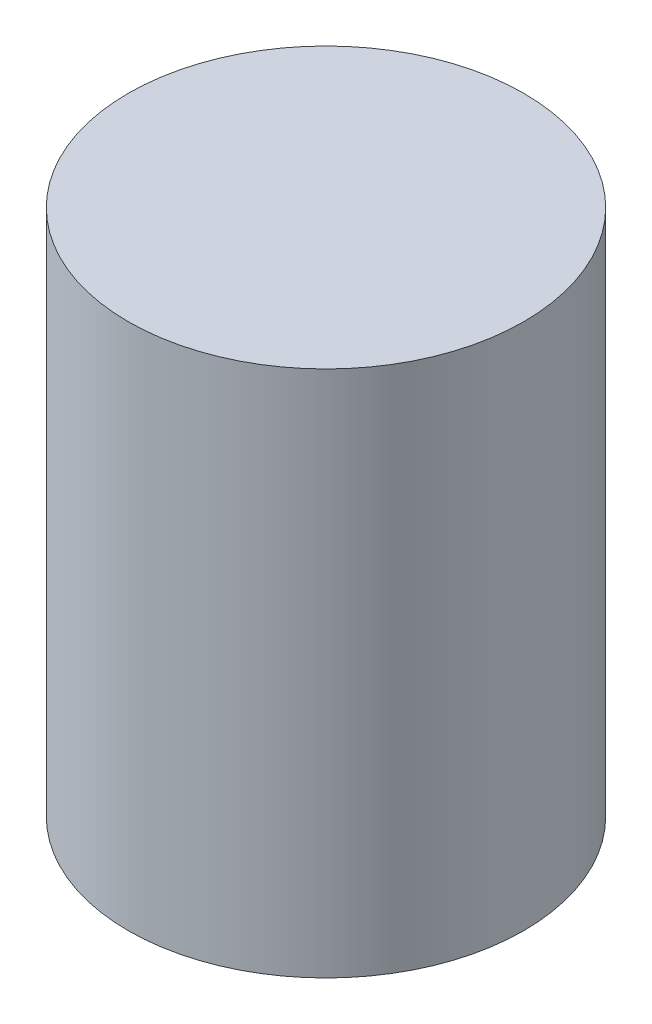
ISO-10303-21;
HEADER;
FILE_DESCRIPTION(('STEP AP214'),'2;1');
FILE_NAME('part.step','',(''),(''),'','','');
FILE_SCHEMA(('AUTOMOTIVE_DESIGN { 1 0 10303 214 1 1 1 1 }'));
ENDSEC;
DATA;
#1=APPLICATION_CONTEXT('core data for automotive mechanical design processes');
#2=APPLICATION_PROTOCOL_DEFINITION('international standard','automotive_design',2000,#1);
#3=PRODUCT_CONTEXT('',#1,'mechanical');
#4=PRODUCT('Part','Part','',(#3));
#5=PRODUCT_RELATED_PRODUCT_CATEGORY('part','',(#4));
#6=PRODUCT_DEFINITION_FORMATION('','',#4);
#7=PRODUCT_DEFINITION_CONTEXT('part definition',#1,'design');
#8=PRODUCT_DEFINITION('design','',#6,#7);
#9=PRODUCT_DEFINITION_SHAPE('','',#8);
#10=(LENGTH_UNIT() NAMED_UNIT(*) SI_UNIT(.MILLI.,.METRE.));
#11=(NAMED_UNIT(*) PLANE_ANGLE_UNIT() SI_UNIT($,.RADIAN.));
#12=(NAMED_UNIT(*) SI_UNIT($,.STERADIAN.) SOLID_ANGLE_UNIT());
#13=UNCERTAINTY_MEASURE_WITH_UNIT(LENGTH_MEASURE(1.E-05),#10,'distance_accuracy_value','');
#14=(GEOMETRIC_REPRESENTATION_CONTEXT(3) GLOBAL_UNCERTAINTY_ASSIGNED_CONTEXT((#13)) GLOBAL_UNIT_ASSIGNED_CONTEXT((#10,
#11,#12)) REPRESENTATION_CONTEXT('',''));
#15=CARTESIAN_POINT('',(0.,0.,0.));
#16=DIRECTION('',(0.,0.,1.));
#17=DIRECTION('',(1.,0.,0.));
#18=AXIS2_PLACEMENT_3D('',#15,#16,#17);
#19=CARTESIAN_POINT('',(0.,6.35,0.));
#20=DIRECTION('',(0.,-1.,0.));
#21=DIRECTION('',(0.,0.,-1.));
#22=AXIS2_PLACEMENT_3D('',#19,#20,#21);
#23=CYLINDRICAL_SURFACE('',#22,2.38125);
#24=CARTESIAN_POINT('',(0.,6.35,0.));
#25=DIRECTION('',(0.,1.,0.));
#26=DIRECTION('',(0.,0.,1.));
#27=AXIS2_PLACEMENT_3D('',#24,#25,#26);
#28=CIRCLE('',#27,2.38125);
#29=CARTESIAN_POINT('',(0.,6.35,2.38125));
#30=VERTEX_POINT('',#29);
#31=EDGE_CURVE('E10',#30,#30,#28,.T.);
#32=ORIENTED_EDGE('',*,*,#31,.F.);
#33=EDGE_LOOP('',(#32));
#34=FACE_BOUND('',#33,.T.);
#35=CARTESIAN_POINT('',(0.,0.,0.));
#36=DIRECTION('',(0.,1.,0.));
#37=DIRECTION('',(0.,0.,1.));
#38=AXIS2_PLACEMENT_3D('',#35,#36,#37);
#39=CIRCLE('',#38,2.38125);
#40=CARTESIAN_POINT('',(0.,0.,2.38125));
#41=VERTEX_POINT('',#40);
#42=EDGE_CURVE('E44',#41,#41,#39,.T.);
#43=ORIENTED_EDGE('',*,*,#42,.T.);
#44=EDGE_LOOP('',(#43));
#45=FACE_BOUND('',#44,.T.);
#46=ADVANCED_FACE('F41',(#34,#45),#23,.T.);
#47=CARTESIAN_POINT('',(0.,6.35,0.));
#48=DIRECTION('',(0.,1.,0.));
#49=DIRECTION('',(0.,0.,1.));
#50=AXIS2_PLACEMENT_3D('',#47,#48,#49);
#51=PLANE('',#50);
#52=ORIENTED_EDGE('',*,*,#31,.T.);
#53=EDGE_LOOP('',(#52));
#54=FACE_BOUND('',#53,.T.);
#55=ADVANCED_FACE('F58',(#54),#51,.T.);
#56=CARTESIAN_POINT('',(0.,0.,0.));
#57=DIRECTION('',(0.,1.,0.));
#58=DIRECTION('',(0.,0.,1.));
#59=AXIS2_PLACEMENT_3D('',#56,#57,#58);
#60=PLANE('',#59);
#61=ORIENTED_EDGE('',*,*,#42,.F.);
#62=EDGE_LOOP('',(#61));
#63=FACE_BOUND('',#62,.T.);
#64=ADVANCED_FACE('F56',(#63),#60,.F.);
#65=CLOSED_SHELL('',(#46,#55,#64));
#66=MANIFOLD_SOLID_BREP('B2',#65);
#67=ADVANCED_BREP_SHAPE_REPRESENTATION('',(#18,#66),#14);
#68=SHAPE_DEFINITION_REPRESENTATION(#9,#67);
ENDSEC;
END-ISO-10303-21;
